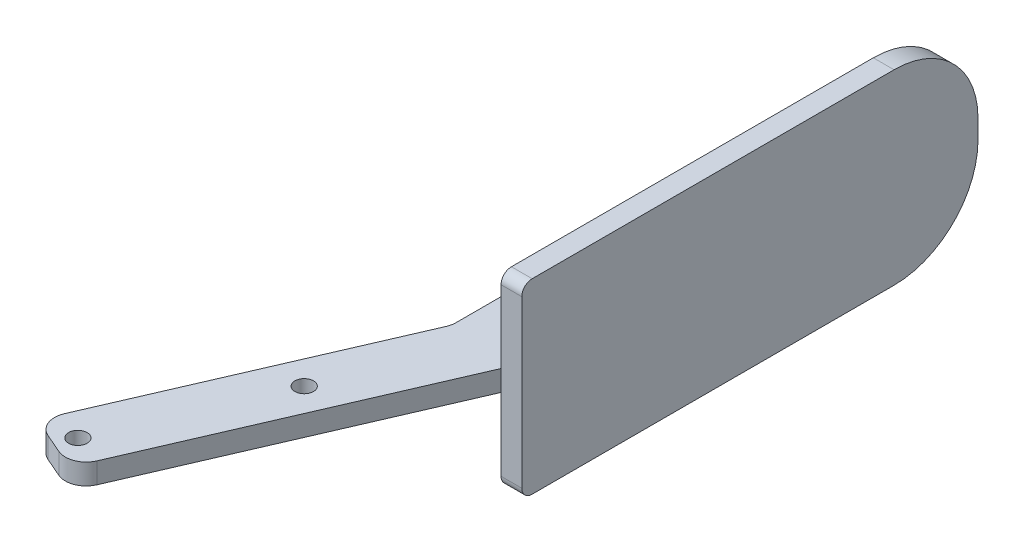
ISO-10303-21;
HEADER;
FILE_DESCRIPTION(('STEP AP214'),'2;1');
FILE_NAME('part.step','',(''),(''),'','','');
FILE_SCHEMA(('AUTOMOTIVE_DESIGN { 1 0 10303 214 1 1 1 1 }'));
ENDSEC;
DATA;
#1=APPLICATION_CONTEXT('core data for automotive mechanical design processes');
#2=APPLICATION_PROTOCOL_DEFINITION('international standard','automotive_design',2000,#1);
#3=PRODUCT_CONTEXT('',#1,'mechanical');
#4=PRODUCT('Part','Part','',(#3));
#5=PRODUCT_RELATED_PRODUCT_CATEGORY('part','',(#4));
#6=PRODUCT_DEFINITION_FORMATION('','',#4);
#7=PRODUCT_DEFINITION_CONTEXT('part definition',#1,'design');
#8=PRODUCT_DEFINITION('design','',#6,#7);
#9=PRODUCT_DEFINITION_SHAPE('','',#8);
#10=(LENGTH_UNIT() NAMED_UNIT(*) SI_UNIT(.MILLI.,.METRE.));
#11=(NAMED_UNIT(*) PLANE_ANGLE_UNIT() SI_UNIT($,.RADIAN.));
#12=(NAMED_UNIT(*) SI_UNIT($,.STERADIAN.) SOLID_ANGLE_UNIT());
#13=UNCERTAINTY_MEASURE_WITH_UNIT(LENGTH_MEASURE(1.E-05),#10,'distance_accuracy_value','');
#14=(GEOMETRIC_REPRESENTATION_CONTEXT(3) GLOBAL_UNCERTAINTY_ASSIGNED_CONTEXT((#13)) GLOBAL_UNIT_ASSIGNED_CONTEXT((#10,
#11,#12)) REPRESENTATION_CONTEXT('',''));
#15=CARTESIAN_POINT('',(0.,0.,0.));
#16=DIRECTION('',(0.,0.,1.));
#17=DIRECTION('',(1.,0.,0.));
#18=AXIS2_PLACEMENT_3D('',#15,#16,#17);
#19=CARTESIAN_POINT('',(3.175,14.2875,0.));
#20=DIRECTION('',(0.,0.,-1.));
#21=DIRECTION('',(-1.,0.,0.));
#22=AXIS2_PLACEMENT_3D('',#19,#20,#21);
#23=PLANE('',#22);
#24=DIRECTION('',(0.,-1.,0.));
#25=VECTOR('',#24,1.);
#26=CARTESIAN_POINT('',(0.,14.2875,0.));
#27=LINE('',#26,#25);
#28=CARTESIAN_POINT('',(0.,-1.5875,0.));
#29=VERTEX_POINT('',#28);
#30=CARTESIAN_POINT('',(0.,-12.7,0.));
#31=VERTEX_POINT('',#30);
#32=EDGE_CURVE('E174',#29,#31,#27,.T.);
#33=ORIENTED_EDGE('',*,*,#32,.T.);
#34=DIRECTION('',(-1.,0.,0.));
#35=VECTOR('',#34,1.);
#36=CARTESIAN_POINT('',(3.175,-12.7,0.));
#37=LINE('',#36,#35);
#38=CARTESIAN_POINT('',(3.175,-12.7,0.));
#39=VERTEX_POINT('',#38);
#40=EDGE_CURVE('E306',#31,#39,#37,.F.);
#41=ORIENTED_EDGE('',*,*,#40,.T.);
#42=DIRECTION('',(0.,-1.,0.));
#43=VECTOR('',#42,1.);
#44=CARTESIAN_POINT('',(3.175,14.2875,0.));
#45=LINE('',#44,#43);
#46=CARTESIAN_POINT('',(3.175,12.7,0.));
#47=VERTEX_POINT('',#46);
#48=EDGE_CURVE('E272',#47,#39,#45,.T.);
#49=ORIENTED_EDGE('',*,*,#48,.F.);
#50=DIRECTION('',(-1.,0.,0.));
#51=VECTOR('',#50,1.);
#52=CARTESIAN_POINT('',(3.175,12.7,0.));
#53=LINE('',#52,#51);
#54=CARTESIAN_POINT('',(0.,12.7,0.));
#55=VERTEX_POINT('',#54);
#56=EDGE_CURVE('E304',#47,#55,#53,.T.);
#57=ORIENTED_EDGE('',*,*,#56,.T.);
#58=CARTESIAN_POINT('',(0.,1.5875,0.));
#59=VERTEX_POINT('',#58);
#60=EDGE_CURVE('E255',#55,#59,#27,.T.);
#61=ORIENTED_EDGE('',*,*,#60,.T.);
#62=DIRECTION('',(0.,-1.,0.));
#63=VECTOR('',#62,1.);
#64=CARTESIAN_POINT('',(0.,1.5875,0.));
#65=LINE('',#64,#63);
#66=EDGE_CURVE('E175',#59,#29,#65,.T.);
#67=ORIENTED_EDGE('',*,*,#66,.T.);
#68=EDGE_LOOP('',(#33,#41,#49,#57,#61,#67));
#69=FACE_BOUND('',#68,.T.);
#70=ADVANCED_FACE('F32',(#69),#23,.F.);
#71=CARTESIAN_POINT('',(3.175,-14.2875,0.));
#72=DIRECTION('',(0.,1.,0.));
#73=DIRECTION('',(0.,0.,1.));
#74=AXIS2_PLACEMENT_3D('',#71,#72,#73);
#75=PLANE('',#74);
#76=DIRECTION('',(0.,0.,-1.));
#77=VECTOR('',#76,1.);
#78=CARTESIAN_POINT('',(3.175,-14.2875,0.));
#79=LINE('',#78,#77);
#80=CARTESIAN_POINT('',(3.175,-14.2875,-1.5875));
#81=VERTEX_POINT('',#80);
#82=CARTESIAN_POINT('',(3.175,-14.2875,-56.9976));
#83=VERTEX_POINT('',#82);
#84=EDGE_CURVE('E359',#81,#83,#79,.T.);
#85=ORIENTED_EDGE('',*,*,#84,.F.);
#86=DIRECTION('',(-1.,0.,0.));
#87=VECTOR('',#86,1.);
#88=CARTESIAN_POINT('',(3.175,-14.2875,-1.5875));
#89=LINE('',#88,#87);
#90=CARTESIAN_POINT('',(0.,-14.2875,-1.5875));
#91=VERTEX_POINT('',#90);
#92=EDGE_CURVE('E250',#81,#91,#89,.T.);
#93=ORIENTED_EDGE('',*,*,#92,.T.);
#94=DIRECTION('',(0.,0.,-1.));
#95=VECTOR('',#94,1.);
#96=CARTESIAN_POINT('',(0.,-14.2875,0.));
#97=LINE('',#96,#95);
#98=CARTESIAN_POINT('',(0.,-14.2875,-56.9976));
#99=VERTEX_POINT('',#98);
#100=EDGE_CURVE('E257',#91,#99,#97,.T.);
#101=ORIENTED_EDGE('',*,*,#100,.T.);
#102=DIRECTION('',(-1.,0.,0.));
#103=VECTOR('',#102,1.);
#104=CARTESIAN_POINT('',(3.175,-14.2875,-56.9976));
#105=LINE('',#104,#103);
#106=EDGE_CURVE('E283',#99,#83,#105,.F.);
#107=ORIENTED_EDGE('',*,*,#106,.T.);
#108=EDGE_LOOP('',(#85,#93,#101,#107));
#109=FACE_BOUND('',#108,.T.);
#110=ADVANCED_FACE('F377',(#109),#75,.F.);
#111=CARTESIAN_POINT('',(3.175,14.2875,-69.85));
#112=DIRECTION('',(0.,0.,1.));
#113=DIRECTION('',(1.,0.,0.));
#114=AXIS2_PLACEMENT_3D('',#111,#112,#113);
#115=PLANE('',#114);
#116=DIRECTION('',(0.,1.,0.));
#117=VECTOR('',#116,1.);
#118=CARTESIAN_POINT('',(3.175,14.2875,-69.85));
#119=LINE('',#118,#117);
#120=CARTESIAN_POINT('',(3.175,-1.4351,-69.85));
#121=VERTEX_POINT('',#120);
#122=CARTESIAN_POINT('',(3.175,1.4351,-69.85));
#123=VERTEX_POINT('',#122);
#124=EDGE_CURVE('E360',#121,#123,#119,.T.);
#125=ORIENTED_EDGE('',*,*,#124,.F.);
#126=DIRECTION('',(-1.,0.,0.));
#127=VECTOR('',#126,1.);
#128=CARTESIAN_POINT('',(3.175,-1.4351,-69.85));
#129=LINE('',#128,#127);
#130=CARTESIAN_POINT('',(0.,-1.4351,-69.85));
#131=VERTEX_POINT('',#130);
#132=EDGE_CURVE('E275',#121,#131,#129,.T.);
#133=ORIENTED_EDGE('',*,*,#132,.T.);
#134=DIRECTION('',(0.,1.,0.));
#135=VECTOR('',#134,1.);
#136=CARTESIAN_POINT('',(0.,14.2875,-69.85));
#137=LINE('',#136,#135);
#138=CARTESIAN_POINT('',(0.,1.4351,-69.85));
#139=VERTEX_POINT('',#138);
#140=EDGE_CURVE('E266',#131,#139,#137,.T.);
#141=ORIENTED_EDGE('',*,*,#140,.T.);
#142=DIRECTION('',(-1.,0.,0.));
#143=VECTOR('',#142,1.);
#144=CARTESIAN_POINT('',(3.175,1.4351,-69.85));
#145=LINE('',#144,#143);
#146=EDGE_CURVE('E273',#139,#123,#145,.F.);
#147=ORIENTED_EDGE('',*,*,#146,.T.);
#148=EDGE_LOOP('',(#125,#133,#141,#147));
#149=FACE_BOUND('',#148,.T.);
#150=ADVANCED_FACE('F384',(#149),#115,.F.);
#151=CARTESIAN_POINT('',(3.175,14.2875,0.));
#152=DIRECTION('',(0.,-1.,0.));
#153=DIRECTION('',(0.,0.,-1.));
#154=AXIS2_PLACEMENT_3D('',#151,#152,#153);
#155=PLANE('',#154);
#156=DIRECTION('',(0.,0.,1.));
#157=VECTOR('',#156,1.);
#158=CARTESIAN_POINT('',(0.,14.2875,0.));
#159=LINE('',#158,#157);
#160=CARTESIAN_POINT('',(0.,14.2875,-56.9976));
#161=VERTEX_POINT('',#160);
#162=CARTESIAN_POINT('',(0.,14.2875,-1.5875));
#163=VERTEX_POINT('',#162);
#164=EDGE_CURVE('E269',#161,#163,#159,.T.);
#165=ORIENTED_EDGE('',*,*,#164,.T.);
#166=DIRECTION('',(-1.,0.,0.));
#167=VECTOR('',#166,1.);
#168=CARTESIAN_POINT('',(3.175,14.2875,-1.5875));
#169=LINE('',#168,#167);
#170=CARTESIAN_POINT('',(3.175,14.2875,-1.5875));
#171=VERTEX_POINT('',#170);
#172=EDGE_CURVE('E314',#163,#171,#169,.F.);
#173=ORIENTED_EDGE('',*,*,#172,.T.);
#174=DIRECTION('',(0.,0.,1.));
#175=VECTOR('',#174,1.);
#176=CARTESIAN_POINT('',(3.175,14.2875,0.));
#177=LINE('',#176,#175);
#178=CARTESIAN_POINT('',(3.175,14.2875,-56.9976));
#179=VERTEX_POINT('',#178);
#180=EDGE_CURVE('E262',#179,#171,#177,.T.);
#181=ORIENTED_EDGE('',*,*,#180,.F.);
#182=DIRECTION('',(-1.,0.,0.));
#183=VECTOR('',#182,1.);
#184=CARTESIAN_POINT('',(3.175,14.2875,-56.9976));
#185=LINE('',#184,#183);
#186=EDGE_CURVE('E254',#179,#161,#185,.T.);
#187=ORIENTED_EDGE('',*,*,#186,.T.);
#188=EDGE_LOOP('',(#165,#173,#181,#187));
#189=FACE_BOUND('',#188,.T.);
#190=ADVANCED_FACE('F294',(#189),#155,.F.);
#191=CARTESIAN_POINT('',(3.175,-14.2875,0.));
#192=DIRECTION('',(1.,0.,0.));
#193=DIRECTION('',(0.,0.,-1.));
#194=AXIS2_PLACEMENT_3D('',#191,#192,#193);
#195=PLANE('',#194);
#196=ORIENTED_EDGE('',*,*,#48,.T.);
#197=CARTESIAN_POINT('',(3.175,-12.7,-1.5875));
#198=DIRECTION('',(1.,0.,0.));
#199=DIRECTION('',(0.,0.,-1.));
#200=AXIS2_PLACEMENT_3D('',#197,#198,#199);
#201=CIRCLE('',#200,1.5875);
#202=EDGE_CURVE('E312',#39,#81,#201,.T.);
#203=ORIENTED_EDGE('',*,*,#202,.T.);
#204=ORIENTED_EDGE('',*,*,#84,.T.);
#205=CARTESIAN_POINT('',(3.175,-1.4351,-56.9976));
#206=DIRECTION('',(1.,0.,0.));
#207=DIRECTION('',(0.,0.,-1.));
#208=AXIS2_PLACEMENT_3D('',#205,#206,#207);
#209=CIRCLE('',#208,12.8524);
#210=EDGE_CURVE('E288',#83,#121,#209,.T.);
#211=ORIENTED_EDGE('',*,*,#210,.T.);
#212=ORIENTED_EDGE('',*,*,#124,.T.);
#213=CARTESIAN_POINT('',(3.175,1.4351,-56.9976));
#214=DIRECTION('',(1.,0.,0.));
#215=DIRECTION('',(0.,0.,-1.));
#216=AXIS2_PLACEMENT_3D('',#213,#214,#215);
#217=CIRCLE('',#216,12.8524);
#218=EDGE_CURVE('E286',#123,#179,#217,.T.);
#219=ORIENTED_EDGE('',*,*,#218,.T.);
#220=ORIENTED_EDGE('',*,*,#180,.T.);
#221=CARTESIAN_POINT('',(3.175,12.7,-1.5875));
#222=DIRECTION('',(1.,0.,0.));
#223=DIRECTION('',(0.,0.,-1.));
#224=AXIS2_PLACEMENT_3D('',#221,#222,#223);
#225=CIRCLE('',#224,1.5875);
#226=EDGE_CURVE('E310',#171,#47,#225,.T.);
#227=ORIENTED_EDGE('',*,*,#226,.T.);
#228=EDGE_LOOP('',(#196,#203,#204,#211,#212,#219,#220,#227));
#229=FACE_BOUND('',#228,.T.);
#230=ADVANCED_FACE('F365',(#229),#195,.T.);
#231=CARTESIAN_POINT('',(0.,-14.2875,0.));
#232=DIRECTION('',(1.,0.,0.));
#233=DIRECTION('',(0.,0.,-1.));
#234=AXIS2_PLACEMENT_3D('',#231,#232,#233);
#235=PLANE('',#234);
#236=ORIENTED_EDGE('',*,*,#100,.F.);
#237=CARTESIAN_POINT('',(0.,-12.7,-1.5875));
#238=DIRECTION('',(1.,0.,0.));
#239=DIRECTION('',(0.,0.,-1.));
#240=AXIS2_PLACEMENT_3D('',#237,#238,#239);
#241=CIRCLE('',#240,1.5875);
#242=EDGE_CURVE('E303',#91,#31,#241,.F.);
#243=ORIENTED_EDGE('',*,*,#242,.T.);
#244=ORIENTED_EDGE('',*,*,#32,.F.);
#245=DIRECTION('',(0.,0.,-1.));
#246=VECTOR('',#245,1.);
#247=CARTESIAN_POINT('',(0.,-1.5875,-55.499));
#248=LINE('',#247,#246);
#249=CARTESIAN_POINT('',(0.,-1.5875,-55.499));
#250=VERTEX_POINT('',#249);
#251=EDGE_CURVE('E170',#29,#250,#248,.T.);
#252=ORIENTED_EDGE('',*,*,#251,.T.);
#253=DIRECTION('',(0.,-1.,0.));
#254=VECTOR('',#253,1.);
#255=CARTESIAN_POINT('',(0.,1.5875,-55.499));
#256=LINE('',#255,#254);
#257=CARTESIAN_POINT('',(0.,1.5875,-55.499));
#258=VERTEX_POINT('',#257);
#259=EDGE_CURVE('E160',#258,#250,#256,.T.);
#260=ORIENTED_EDGE('',*,*,#259,.F.);
#261=DIRECTION('',(0.,0.,-1.));
#262=VECTOR('',#261,1.);
#263=CARTESIAN_POINT('',(0.,1.5875,-55.499));
#264=LINE('',#263,#262);
#265=EDGE_CURVE('E166',#59,#258,#264,.T.);
#266=ORIENTED_EDGE('',*,*,#265,.F.);
#267=ORIENTED_EDGE('',*,*,#60,.F.);
#268=CARTESIAN_POINT('',(0.,12.7,-1.5875));
#269=DIRECTION('',(1.,0.,0.));
#270=DIRECTION('',(0.,0.,-1.));
#271=AXIS2_PLACEMENT_3D('',#268,#269,#270);
#272=CIRCLE('',#271,1.5875);
#273=EDGE_CURVE('E253',#55,#163,#272,.F.);
#274=ORIENTED_EDGE('',*,*,#273,.T.);
#275=ORIENTED_EDGE('',*,*,#164,.F.);
#276=CARTESIAN_POINT('',(0.,1.4351,-56.9976));
#277=DIRECTION('',(1.,0.,0.));
#278=DIRECTION('',(0.,0.,-1.));
#279=AXIS2_PLACEMENT_3D('',#276,#277,#278);
#280=CIRCLE('',#279,12.8524);
#281=EDGE_CURVE('E278',#161,#139,#280,.F.);
#282=ORIENTED_EDGE('',*,*,#281,.T.);
#283=ORIENTED_EDGE('',*,*,#140,.F.);
#284=CARTESIAN_POINT('',(0.,-1.4351,-56.9976));
#285=DIRECTION('',(1.,0.,0.));
#286=DIRECTION('',(0.,0.,-1.));
#287=AXIS2_PLACEMENT_3D('',#284,#285,#286);
#288=CIRCLE('',#287,12.8524);
#289=EDGE_CURVE('E280',#131,#99,#288,.F.);
#290=ORIENTED_EDGE('',*,*,#289,.T.);
#291=EDGE_LOOP('',(#236,#243,#244,#252,#260,#266,#267,#274,#275,#282,#283,#290));
#292=FACE_BOUND('',#291,.T.);
#293=ADVANCED_FACE('F163',(#292),#235,.F.);
#294=CARTESIAN_POINT('',(3.175,-1.4351,-56.9976));
#295=DIRECTION('',(-1.,0.,0.));
#296=DIRECTION('',(0.,0.,1.));
#297=AXIS2_PLACEMENT_3D('',#294,#295,#296);
#298=CYLINDRICAL_SURFACE('',#297,12.8524);
#299=ORIENTED_EDGE('',*,*,#210,.F.);
#300=ORIENTED_EDGE('',*,*,#106,.F.);
#301=ORIENTED_EDGE('',*,*,#289,.F.);
#302=ORIENTED_EDGE('',*,*,#132,.F.);
#303=EDGE_LOOP('',(#299,#300,#301,#302));
#304=FACE_BOUND('',#303,.T.);
#305=ADVANCED_FACE('F382',(#304),#298,.T.);
#306=CARTESIAN_POINT('',(3.175,1.4351,-56.9976));
#307=DIRECTION('',(-1.,0.,0.));
#308=DIRECTION('',(0.,0.,1.));
#309=AXIS2_PLACEMENT_3D('',#306,#307,#308);
#310=CYLINDRICAL_SURFACE('',#309,12.8524);
#311=ORIENTED_EDGE('',*,*,#218,.F.);
#312=ORIENTED_EDGE('',*,*,#146,.F.);
#313=ORIENTED_EDGE('',*,*,#281,.F.);
#314=ORIENTED_EDGE('',*,*,#186,.F.);
#315=EDGE_LOOP('',(#311,#312,#313,#314));
#316=FACE_BOUND('',#315,.T.);
#317=ADVANCED_FACE('F386',(#316),#310,.T.);
#318=CARTESIAN_POINT('',(-9.525,1.5875,-55.499));
#319=DIRECTION('',(0.,0.,1.));
#320=DIRECTION('',(1.,0.,0.));
#321=AXIS2_PLACEMENT_3D('',#318,#319,#320);
#322=PLANE('',#321);
#323=DIRECTION('',(-1.,0.,0.));
#324=VECTOR('',#323,1.);
#325=CARTESIAN_POINT('',(-9.525,-1.5875,-55.499));
#326=LINE('',#325,#324);
#327=CARTESIAN_POINT('',(-6.35,-1.5875,-55.499));
#328=VERTEX_POINT('',#327);
#329=EDGE_CURVE('E228',#250,#328,#326,.T.);
#330=ORIENTED_EDGE('',*,*,#329,.T.);
#331=DIRECTION('',(0.,-1.,0.));
#332=VECTOR('',#331,1.);
#333=CARTESIAN_POINT('',(-6.35,1.5875,-55.499));
#334=LINE('',#333,#332);
#335=CARTESIAN_POINT('',(-6.35,1.5875,-55.499));
#336=VERTEX_POINT('',#335);
#337=EDGE_CURVE('E181',#328,#336,#334,.F.);
#338=ORIENTED_EDGE('',*,*,#337,.T.);
#339=DIRECTION('',(-1.,0.,0.));
#340=VECTOR('',#339,1.);
#341=CARTESIAN_POINT('',(-9.525,1.5875,-55.499));
#342=LINE('',#341,#340);
#343=EDGE_CURVE('E178',#258,#336,#342,.T.);
#344=ORIENTED_EDGE('',*,*,#343,.F.);
#345=ORIENTED_EDGE('',*,*,#259,.T.);
#346=EDGE_LOOP('',(#330,#338,#344,#345));
#347=FACE_BOUND('',#346,.T.);
#348=ADVANCED_FACE('F179',(#347),#322,.F.);
#349=CARTESIAN_POINT('',(-9.525,1.5875,-1.97257759827113));
#350=DIRECTION('',(1.,0.,0.));
#351=DIRECTION('',(0.,0.,-1.));
#352=AXIS2_PLACEMENT_3D('',#349,#350,#351);
#353=PLANE('',#352);
#354=DIRECTION('',(0.,0.,1.));
#355=VECTOR('',#354,1.);
#356=CARTESIAN_POINT('',(-9.525,1.5875,-1.97257759827113));
#357=LINE('',#356,#355);
#358=CARTESIAN_POINT('',(-9.525,1.5875,-52.324));
#359=VERTEX_POINT('',#358);
#360=CARTESIAN_POINT('',(-9.525,1.5875,-2.6301034643615));
#361=VERTEX_POINT('',#360);
#362=EDGE_CURVE('E183',#359,#361,#357,.T.);
#363=ORIENTED_EDGE('',*,*,#362,.F.);
#364=DIRECTION('',(0.,-1.,0.));
#365=VECTOR('',#364,1.);
#366=CARTESIAN_POINT('',(-9.525,1.5875,-52.324));
#367=LINE('',#366,#365);
#368=CARTESIAN_POINT('',(-9.525,-1.5875,-52.324));
#369=VERTEX_POINT('',#368);
#370=EDGE_CURVE('E318',#359,#369,#367,.T.);
#371=ORIENTED_EDGE('',*,*,#370,.T.);
#372=DIRECTION('',(0.,0.,1.));
#373=VECTOR('',#372,1.);
#374=CARTESIAN_POINT('',(-9.525,-1.5875,-1.97257759827113));
#375=LINE('',#374,#373);
#376=CARTESIAN_POINT('',(-9.525,-1.5875,-2.6301034643615));
#377=VERTEX_POINT('',#376);
#378=EDGE_CURVE('E329',#369,#377,#375,.T.);
#379=ORIENTED_EDGE('',*,*,#378,.T.);
#380=DIRECTION('',(0.,-1.,0.));
#381=VECTOR('',#380,1.);
#382=CARTESIAN_POINT('',(-9.525,1.5875,-2.6301034643615));
#383=LINE('',#382,#381);
#384=EDGE_CURVE('E316',#377,#361,#383,.F.);
#385=ORIENTED_EDGE('',*,*,#384,.T.);
#386=EDGE_LOOP('',(#363,#371,#379,#385));
#387=FACE_BOUND('',#386,.T.);
#388=ADVANCED_FACE('F336',(#387),#353,.F.);
#389=CARTESIAN_POINT('',(-28.6917578193364,1.5875,42.3180872724994));
#390=DIRECTION('',(0.917751033376927,0.,0.397156191863581));
#391=DIRECTION('',(0.397156191863581,0.,-0.917751033376927));
#392=AXIS2_PLACEMENT_3D('',#389,#390,#391);
#393=PLANE('',#392);
#394=DIRECTION('',(-0.397156191863581,0.,0.917751033376927));
#395=VECTOR('',#394,1.);
#396=CARTESIAN_POINT('',(-28.6917578193364,1.5875,42.3180872724994));
#397=LINE('',#396,#395);
#398=CARTESIAN_POINT('',(-9.78614046902826,1.5875,-1.36913255519462));
#399=VERTEX_POINT('',#398);
#400=CARTESIAN_POINT('',(-27.4307869101696,1.5875,39.4042277415276));
#401=VERTEX_POINT('',#400);
#402=EDGE_CURVE('E240',#399,#401,#397,.T.);
#403=ORIENTED_EDGE('',*,*,#402,.F.);
#404=DIRECTION('',(0.,-1.,0.));
#405=VECTOR('',#404,1.);
#406=CARTESIAN_POINT('',(-9.78614046902826,-1.5875,-1.36913255519463));
#407=LINE('',#406,#405);
#408=CARTESIAN_POINT('',(-9.78614046902826,-1.5875,-1.36913255519462));
#409=VERTEX_POINT('',#408);
#410=EDGE_CURVE('E213',#399,#409,#407,.T.);
#411=ORIENTED_EDGE('',*,*,#410,.T.);
#412=DIRECTION('',(-0.397156191863581,0.,0.917751033376927));
#413=VECTOR('',#412,1.);
#414=CARTESIAN_POINT('',(-28.6917578193364,-1.5875,42.3180872724994));
#415=LINE('',#414,#413);
#416=CARTESIAN_POINT('',(-27.4307869101696,-1.5875,39.4042277415276));
#417=VERTEX_POINT('',#416);
#418=EDGE_CURVE('E348',#409,#417,#415,.T.);
#419=ORIENTED_EDGE('',*,*,#418,.T.);
#420=DIRECTION('',(0.,-1.,0.));
#421=VECTOR('',#420,1.);
#422=CARTESIAN_POINT('',(-27.4307869101696,1.5875,39.4042277415276));
#423=LINE('',#422,#421);
#424=EDGE_CURVE('E211',#417,#401,#423,.F.);
#425=ORIENTED_EDGE('',*,*,#424,.T.);
#426=EDGE_LOOP('',(#403,#411,#419,#425));
#427=FACE_BOUND('',#426,.T.);
#428=ADVANCED_FACE('F344',(#427),#393,.F.);
#429=CARTESIAN_POINT('',(-19.9501792264212,1.5875,46.101));
#430=DIRECTION('',(0.397156191863581,0.,-0.917751033376928));
#431=DIRECTION('',(-0.917751033376928,0.,-0.397156191863581));
#432=AXIS2_PLACEMENT_3D('',#429,#430,#431);
#433=PLANE('',#432);
#434=DIRECTION('',(0.917751033376928,0.,0.397156191863581));
#435=VECTOR('',#434,1.);
#436=CARTESIAN_POINT('',(-19.9501792264212,-1.5875,46.101));
#437=LINE('',#436,#435);
#438=CARTESIAN_POINT('',(-25.7778982883647,-1.5875,43.5790581816663));
#439=VERTEX_POINT('',#438);
#440=CARTESIAN_POINT('',(-22.864038757393,-1.5875,44.8400290908331));
#441=VERTEX_POINT('',#440);
#442=EDGE_CURVE('E190',#439,#441,#437,.T.);
#443=ORIENTED_EDGE('',*,*,#442,.T.);
#444=DIRECTION('',(0.,-1.,0.));
#445=VECTOR('',#444,1.);
#446=CARTESIAN_POINT('',(-22.864038757393,1.5875,44.8400290908331));
#447=LINE('',#446,#445);
#448=CARTESIAN_POINT('',(-22.864038757393,1.5875,44.8400290908331));
#449=VERTEX_POINT('',#448);
#450=EDGE_CURVE('E57',#441,#449,#447,.F.);
#451=ORIENTED_EDGE('',*,*,#450,.T.);
#452=DIRECTION('',(0.917751033376928,0.,0.397156191863581));
#453=VECTOR('',#452,1.);
#454=CARTESIAN_POINT('',(-19.9501792264212,1.5875,46.101));
#455=LINE('',#454,#453);
#456=CARTESIAN_POINT('',(-25.7778982883647,1.5875,43.5790581816663));
#457=VERTEX_POINT('',#456);
#458=EDGE_CURVE('E204',#457,#449,#455,.T.);
#459=ORIENTED_EDGE('',*,*,#458,.F.);
#460=DIRECTION('',(0.,-1.,0.));
#461=VECTOR('',#460,1.);
#462=CARTESIAN_POINT('',(-25.7778982883647,1.5875,43.5790581816663));
#463=LINE('',#462,#461);
#464=EDGE_CURVE('E219',#457,#439,#463,.T.);
#465=ORIENTED_EDGE('',*,*,#464,.T.);
#466=EDGE_LOOP('',(#443,#451,#459,#465));
#467=FACE_BOUND('',#466,.T.);
#468=ADVANCED_FACE('F351',(#467),#433,.F.);
#469=CARTESIAN_POINT('',(0.,1.5875,0.));
#470=DIRECTION('',(-0.917751033376927,0.,-0.397156191863582));
#471=DIRECTION('',(-0.397156191863582,0.,0.917751033376927));
#472=AXIS2_PLACEMENT_3D('',#469,#470,#471);
#473=PLANE('',#472);
#474=DIRECTION('',(0.397156191863581,0.,-0.917751033376927));
#475=VECTOR('',#474,1.);
#476=CARTESIAN_POINT('',(0.,1.5875,0.));
#477=LINE('',#476,#475);
#478=CARTESIAN_POINT('',(-18.6892083172543,1.5875,43.1871404690283));
#479=VERTEX_POINT('',#478);
#480=EDGE_CURVE('E186',#479,#59,#477,.T.);
#481=ORIENTED_EDGE('',*,*,#480,.F.);
#482=DIRECTION('',(0.,-1.,0.));
#483=VECTOR('',#482,1.);
#484=CARTESIAN_POINT('',(-18.6892083172543,1.5875,43.1871404690283));
#485=LINE('',#484,#483);
#486=CARTESIAN_POINT('',(-18.6892083172543,-1.5875,43.1871404690283));
#487=VERTEX_POINT('',#486);
#488=EDGE_CURVE('E216',#479,#487,#485,.T.);
#489=ORIENTED_EDGE('',*,*,#488,.T.);
#490=DIRECTION('',(0.397156191863581,0.,-0.917751033376927));
#491=VECTOR('',#490,1.);
#492=CARTESIAN_POINT('',(0.,-1.5875,0.));
#493=LINE('',#492,#491);
#494=EDGE_CURVE('E188',#487,#29,#493,.T.);
#495=ORIENTED_EDGE('',*,*,#494,.T.);
#496=ORIENTED_EDGE('',*,*,#66,.F.);
#497=EDGE_LOOP('',(#481,#489,#495,#496));
#498=FACE_BOUND('',#497,.T.);
#499=ADVANCED_FACE('F417',(#498),#473,.F.);
#500=CARTESIAN_POINT('',(0.,1.5875,-55.499));
#501=DIRECTION('',(0.,1.,0.));
#502=DIRECTION('',(0.,0.,1.));
#503=AXIS2_PLACEMENT_3D('',#500,#501,#502);
#504=PLANE('',#503);
#505=CARTESIAN_POINT('',(-12.7250800421803,1.5875,17.4136913894335));
#506=DIRECTION('',(0.,1.,0.));
#507=DIRECTION('',(0.,0.,1.));
#508=AXIS2_PLACEMENT_3D('',#505,#506,#507);
#509=CIRCLE('',#508,1.42240000000001);
#510=CARTESIAN_POINT('',(-12.7250800421803,1.5875,18.8360913894335));
#511=VERTEX_POINT('',#510);
#512=EDGE_CURVE('E235',#511,#511,#509,.T.);
#513=ORIENTED_EDGE('',*,*,#512,.F.);
#514=EDGE_LOOP('',(#513));
#515=FACE_BOUND('',#514,.T.);
#516=CARTESIAN_POINT('',(-23.1911385882653,1.5875,41.598725496499));
#517=DIRECTION('',(0.,1.,0.));
#518=DIRECTION('',(0.,0.,1.));
#519=AXIS2_PLACEMENT_3D('',#516,#517,#518);
#520=CIRCLE('',#519,1.42240000000001);
#521=CARTESIAN_POINT('',(-23.1911385882653,1.5875,43.021125496499));
#522=VERTEX_POINT('',#521);
#523=EDGE_CURVE('E225',#522,#522,#520,.T.);
#524=ORIENTED_EDGE('',*,*,#523,.F.);
#525=EDGE_LOOP('',(#524));
#526=FACE_BOUND('',#525,.T.);
#527=ORIENTED_EDGE('',*,*,#343,.T.);
#528=CARTESIAN_POINT('',(-6.35,1.5875,-52.324));
#529=DIRECTION('',(0.,1.,0.));
#530=DIRECTION('',(0.,0.,1.));
#531=AXIS2_PLACEMENT_3D('',#528,#529,#530);
#532=CIRCLE('',#531,3.175);
#533=EDGE_CURVE('E209',#336,#359,#532,.T.);
#534=ORIENTED_EDGE('',*,*,#533,.T.);
#535=ORIENTED_EDGE('',*,*,#362,.T.);
#536=CARTESIAN_POINT('',(-12.7,1.5875,-2.6301034643615));
#537=DIRECTION('',(0.,1.,0.));
#538=DIRECTION('',(0.,0.,1.));
#539=AXIS2_PLACEMENT_3D('',#536,#537,#538);
#540=CIRCLE('',#539,3.175);
#541=EDGE_CURVE('E11',#361,#399,#540,.F.);
#542=ORIENTED_EDGE('',*,*,#541,.T.);
#543=ORIENTED_EDGE('',*,*,#402,.T.);
#544=CARTESIAN_POINT('',(-24.5169273791978,1.5875,40.6651986506945));
#545=DIRECTION('',(0.,1.,0.));
#546=DIRECTION('',(0.,0.,1.));
#547=AXIS2_PLACEMENT_3D('',#544,#545,#546);
#548=CIRCLE('',#547,3.175);
#549=EDGE_CURVE('E206',#401,#457,#548,.T.);
#550=ORIENTED_EDGE('',*,*,#549,.T.);
#551=ORIENTED_EDGE('',*,*,#458,.T.);
#552=CARTESIAN_POINT('',(-21.6030678482261,1.5875,41.9261695598614));
#553=DIRECTION('',(0.,1.,0.));
#554=DIRECTION('',(0.,0.,1.));
#555=AXIS2_PLACEMENT_3D('',#552,#553,#554);
#556=CIRCLE('',#555,3.175);
#557=EDGE_CURVE('E49',#449,#479,#556,.T.);
#558=ORIENTED_EDGE('',*,*,#557,.T.);
#559=ORIENTED_EDGE('',*,*,#480,.T.);
#560=ORIENTED_EDGE('',*,*,#265,.T.);
#561=EDGE_LOOP('',(#527,#534,#535,#542,#543,#550,#551,#558,#559,#560));
#562=FACE_BOUND('',#561,.T.);
#563=ADVANCED_FACE('F185',(#515,#526,#562),#504,.T.);
#564=CARTESIAN_POINT('',(0.,-1.5875,-55.499));
#565=DIRECTION('',(0.,1.,0.));
#566=DIRECTION('',(0.,0.,1.));
#567=AXIS2_PLACEMENT_3D('',#564,#565,#566);
#568=PLANE('',#567);
#569=CARTESIAN_POINT('',(-12.7250800421803,-1.5875,17.4136913894335));
#570=DIRECTION('',(0.,1.,0.));
#571=DIRECTION('',(0.,0.,1.));
#572=AXIS2_PLACEMENT_3D('',#569,#570,#571);
#573=CIRCLE('',#572,1.42240000000001);
#574=CARTESIAN_POINT('',(-12.7250800421803,-1.5875,18.8360913894335));
#575=VERTEX_POINT('',#574);
#576=EDGE_CURVE('E36',#575,#575,#573,.T.);
#577=ORIENTED_EDGE('',*,*,#576,.T.);
#578=EDGE_LOOP('',(#577));
#579=FACE_BOUND('',#578,.T.);
#580=CARTESIAN_POINT('',(-23.1911385882653,-1.5875,41.598725496499));
#581=DIRECTION('',(0.,1.,0.));
#582=DIRECTION('',(0.,0.,1.));
#583=AXIS2_PLACEMENT_3D('',#580,#581,#582);
#584=CIRCLE('',#583,1.42240000000001);
#585=CARTESIAN_POINT('',(-23.1911385882653,-1.5875,43.021125496499));
#586=VERTEX_POINT('',#585);
#587=EDGE_CURVE('E223',#586,#586,#584,.T.);
#588=ORIENTED_EDGE('',*,*,#587,.T.);
#589=EDGE_LOOP('',(#588));
#590=FACE_BOUND('',#589,.T.);
#591=ORIENTED_EDGE('',*,*,#378,.F.);
#592=CARTESIAN_POINT('',(-6.35,-1.5875,-52.324));
#593=DIRECTION('',(0.,1.,0.));
#594=DIRECTION('',(0.,0.,1.));
#595=AXIS2_PLACEMENT_3D('',#592,#593,#594);
#596=CIRCLE('',#595,3.175);
#597=EDGE_CURVE('E324',#369,#328,#596,.F.);
#598=ORIENTED_EDGE('',*,*,#597,.T.);
#599=ORIENTED_EDGE('',*,*,#329,.F.);
#600=ORIENTED_EDGE('',*,*,#251,.F.);
#601=ORIENTED_EDGE('',*,*,#494,.F.);
#602=CARTESIAN_POINT('',(-21.6030678482261,-1.5875,41.9261695598614));
#603=DIRECTION('',(0.,1.,0.));
#604=DIRECTION('',(0.,0.,1.));
#605=AXIS2_PLACEMENT_3D('',#602,#603,#604);
#606=CIRCLE('',#605,3.175);
#607=EDGE_CURVE('E323',#487,#441,#606,.F.);
#608=ORIENTED_EDGE('',*,*,#607,.T.);
#609=ORIENTED_EDGE('',*,*,#442,.F.);
#610=CARTESIAN_POINT('',(-24.5169273791978,-1.5875,40.6651986506945));
#611=DIRECTION('',(0.,1.,0.));
#612=DIRECTION('',(0.,0.,1.));
#613=AXIS2_PLACEMENT_3D('',#610,#611,#612);
#614=CIRCLE('',#613,3.175);
#615=EDGE_CURVE('E320',#439,#417,#614,.F.);
#616=ORIENTED_EDGE('',*,*,#615,.T.);
#617=ORIENTED_EDGE('',*,*,#418,.F.);
#618=CARTESIAN_POINT('',(-12.7,-1.5875,-2.6301034643615));
#619=DIRECTION('',(0.,1.,0.));
#620=DIRECTION('',(0.,0.,1.));
#621=AXIS2_PLACEMENT_3D('',#618,#619,#620);
#622=CIRCLE('',#621,3.175);
#623=EDGE_CURVE('E41',#409,#377,#622,.T.);
#624=ORIENTED_EDGE('',*,*,#623,.T.);
#625=EDGE_LOOP('',(#591,#598,#599,#600,#601,#608,#609,#616,#617,#624));
#626=FACE_BOUND('',#625,.T.);
#627=ADVANCED_FACE('F327',(#579,#590,#626),#568,.F.);
#628=CARTESIAN_POINT('',(3.175,-12.7,-1.5875));
#629=DIRECTION('',(-1.,0.,0.));
#630=DIRECTION('',(0.,0.,1.));
#631=AXIS2_PLACEMENT_3D('',#628,#629,#630);
#632=CYLINDRICAL_SURFACE('',#631,1.5875);
#633=ORIENTED_EDGE('',*,*,#202,.F.);
#634=ORIENTED_EDGE('',*,*,#40,.F.);
#635=ORIENTED_EDGE('',*,*,#242,.F.);
#636=ORIENTED_EDGE('',*,*,#92,.F.);
#637=EDGE_LOOP('',(#633,#634,#635,#636));
#638=FACE_BOUND('',#637,.T.);
#639=ADVANCED_FACE('F375',(#638),#632,.T.);
#640=CARTESIAN_POINT('',(3.175,12.7,-1.5875));
#641=DIRECTION('',(-1.,0.,0.));
#642=DIRECTION('',(0.,0.,1.));
#643=AXIS2_PLACEMENT_3D('',#640,#641,#642);
#644=CYLINDRICAL_SURFACE('',#643,1.5875);
#645=ORIENTED_EDGE('',*,*,#226,.F.);
#646=ORIENTED_EDGE('',*,*,#172,.F.);
#647=ORIENTED_EDGE('',*,*,#273,.F.);
#648=ORIENTED_EDGE('',*,*,#56,.F.);
#649=EDGE_LOOP('',(#645,#646,#647,#648));
#650=FACE_BOUND('',#649,.T.);
#651=ADVANCED_FACE('F367',(#650),#644,.T.);
#652=CARTESIAN_POINT('',(-6.35,1.5875,-52.324));
#653=DIRECTION('',(0.,-1.,0.));
#654=DIRECTION('',(0.,0.,-1.));
#655=AXIS2_PLACEMENT_3D('',#652,#653,#654);
#656=CYLINDRICAL_SURFACE('',#655,3.175);
#657=ORIENTED_EDGE('',*,*,#533,.F.);
#658=ORIENTED_EDGE('',*,*,#337,.F.);
#659=ORIENTED_EDGE('',*,*,#597,.F.);
#660=ORIENTED_EDGE('',*,*,#370,.F.);
#661=EDGE_LOOP('',(#657,#658,#659,#660));
#662=FACE_BOUND('',#661,.T.);
#663=ADVANCED_FACE('F332',(#662),#656,.T.);
#664=CARTESIAN_POINT('',(-12.7,1.5875,-2.6301034643615));
#665=DIRECTION('',(0.,1.,0.));
#666=DIRECTION('',(0.,0.,1.));
#667=AXIS2_PLACEMENT_3D('',#664,#665,#666);
#668=CYLINDRICAL_SURFACE('',#667,3.175);
#669=ORIENTED_EDGE('',*,*,#541,.F.);
#670=ORIENTED_EDGE('',*,*,#384,.F.);
#671=ORIENTED_EDGE('',*,*,#623,.F.);
#672=ORIENTED_EDGE('',*,*,#410,.F.);
#673=EDGE_LOOP('',(#669,#670,#671,#672));
#674=FACE_BOUND('',#673,.T.);
#675=ADVANCED_FACE('F339',(#674),#668,.F.);
#676=CARTESIAN_POINT('',(-21.6030678482261,1.5875,41.9261695598614));
#677=DIRECTION('',(0.,-1.,0.));
#678=DIRECTION('',(0.,0.,-1.));
#679=AXIS2_PLACEMENT_3D('',#676,#677,#678);
#680=CYLINDRICAL_SURFACE('',#679,3.175);
#681=ORIENTED_EDGE('',*,*,#557,.F.);
#682=ORIENTED_EDGE('',*,*,#450,.F.);
#683=ORIENTED_EDGE('',*,*,#607,.F.);
#684=ORIENTED_EDGE('',*,*,#488,.F.);
#685=EDGE_LOOP('',(#681,#682,#683,#684));
#686=FACE_BOUND('',#685,.T.);
#687=ADVANCED_FACE('F452',(#686),#680,.T.);
#688=CARTESIAN_POINT('',(-24.5169273791978,1.5875,40.6651986506945));
#689=DIRECTION('',(0.,-1.,0.));
#690=DIRECTION('',(0.,0.,-1.));
#691=AXIS2_PLACEMENT_3D('',#688,#689,#690);
#692=CYLINDRICAL_SURFACE('',#691,3.175);
#693=ORIENTED_EDGE('',*,*,#549,.F.);
#694=ORIENTED_EDGE('',*,*,#424,.F.);
#695=ORIENTED_EDGE('',*,*,#615,.F.);
#696=ORIENTED_EDGE('',*,*,#464,.F.);
#697=EDGE_LOOP('',(#693,#694,#695,#696));
#698=FACE_BOUND('',#697,.T.);
#699=ADVANCED_FACE('F34',(#698),#692,.T.);
#700=CARTESIAN_POINT('',(-23.1911385882653,1.5875,41.598725496499));
#701=DIRECTION('',(0.,1.,0.));
#702=DIRECTION('',(0.,0.,1.));
#703=AXIS2_PLACEMENT_3D('',#700,#701,#702);
#704=CYLINDRICAL_SURFACE('',#703,1.42240000000001);
#705=ORIENTED_EDGE('',*,*,#523,.T.);
#706=EDGE_LOOP('',(#705));
#707=FACE_BOUND('',#706,.T.);
#708=ORIENTED_EDGE('',*,*,#587,.F.);
#709=EDGE_LOOP('',(#708));
#710=FACE_BOUND('',#709,.T.);
#711=ADVANCED_FACE('F427',(#707,#710),#704,.F.);
#712=CARTESIAN_POINT('',(-12.7250800421803,1.5875,17.4136913894335));
#713=DIRECTION('',(0.,1.,0.));
#714=DIRECTION('',(0.,0.,1.));
#715=AXIS2_PLACEMENT_3D('',#712,#713,#714);
#716=CYLINDRICAL_SURFACE('',#715,1.42240000000001);
#717=ORIENTED_EDGE('',*,*,#512,.T.);
#718=EDGE_LOOP('',(#717));
#719=FACE_BOUND('',#718,.T.);
#720=ORIENTED_EDGE('',*,*,#576,.F.);
#721=EDGE_LOOP('',(#720));
#722=FACE_BOUND('',#721,.T.);
#723=ADVANCED_FACE('F430',(#719,#722),#716,.F.);
#724=CLOSED_SHELL('',(#70,#110,#150,#190,#230,#293,#305,#317,#348,#388,#428,#468,#499,#563,#627,
#639,#651,#663,#675,#687,#699,#711,#723));
#725=MANIFOLD_SOLID_BREP('B2',#724);
#726=ADVANCED_BREP_SHAPE_REPRESENTATION('',(#18,#725),#14);
#727=SHAPE_DEFINITION_REPRESENTATION(#9,#726);
ENDSEC;
END-ISO-10303-21;
